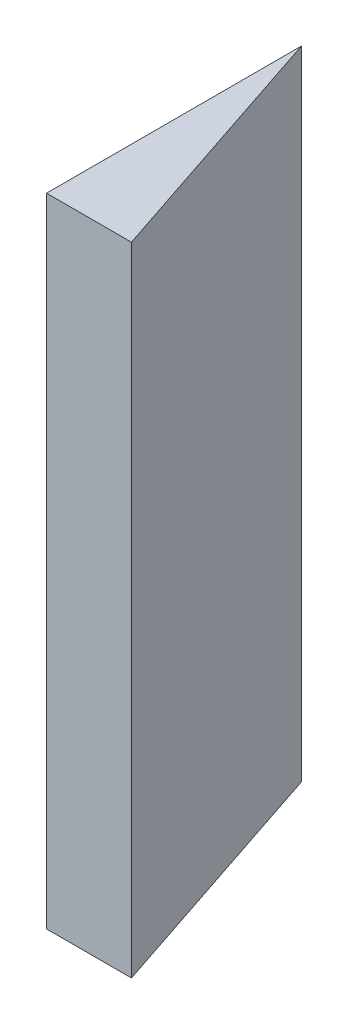
ISO-10303-21;
HEADER;
FILE_DESCRIPTION(('STEP AP214'),'2;1');
FILE_NAME('part.step','',(''),(''),'','','');
FILE_SCHEMA(('AUTOMOTIVE_DESIGN { 1 0 10303 214 1 1 1 1 }'));
ENDSEC;
DATA;
#1=APPLICATION_CONTEXT('core data for automotive mechanical design processes');
#2=APPLICATION_PROTOCOL_DEFINITION('international standard','automotive_design',2000,#1);
#3=PRODUCT_CONTEXT('',#1,'mechanical');
#4=PRODUCT('Part','Part','',(#3));
#5=PRODUCT_RELATED_PRODUCT_CATEGORY('part','',(#4));
#6=PRODUCT_DEFINITION_FORMATION('','',#4);
#7=PRODUCT_DEFINITION_CONTEXT('part definition',#1,'design');
#8=PRODUCT_DEFINITION('design','',#6,#7);
#9=PRODUCT_DEFINITION_SHAPE('','',#8);
#10=(LENGTH_UNIT() NAMED_UNIT(*) SI_UNIT(.MILLI.,.METRE.));
#11=(NAMED_UNIT(*) PLANE_ANGLE_UNIT() SI_UNIT($,.RADIAN.));
#12=(NAMED_UNIT(*) SI_UNIT($,.STERADIAN.) SOLID_ANGLE_UNIT());
#13=UNCERTAINTY_MEASURE_WITH_UNIT(LENGTH_MEASURE(1.E-05),#10,'distance_accuracy_value','');
#14=(GEOMETRIC_REPRESENTATION_CONTEXT(3) GLOBAL_UNCERTAINTY_ASSIGNED_CONTEXT((#13)) GLOBAL_UNIT_ASSIGNED_CONTEXT((#10,
#11,#12)) REPRESENTATION_CONTEXT('',''));
#15=CARTESIAN_POINT('',(0.,0.,0.));
#16=DIRECTION('',(0.,0.,1.));
#17=DIRECTION('',(1.,0.,0.));
#18=AXIS2_PLACEMENT_3D('',#15,#16,#17);
#19=CARTESIAN_POINT('',(-3.9200001311342,-0.749999496443807,-3.67112158656318));
#20=DIRECTION('',(-1.74845553146952E-07,-1.,-8.74227765734759E-08));
#21=DIRECTION('',(1.,-1.74845553146952E-07,0.));
#22=AXIS2_PLACEMENT_3D('',#19,#20,#21);
#23=PLANE('',#22);
#24=DIRECTION('',(0.,8.74227765179643E-08,-0.999999999999996));
#25=VECTOR('',#24,1.);
#26=CARTESIAN_POINT('',(-3.9000001311342,-0.749999536658284,-3.25112158656318));
#27=LINE('',#26,#25);
#28=CARTESIAN_POINT('',(-3.9000001311342,-0.749999536660284,-3.25112158656318));
#29=VERTEX_POINT('',#28);
#30=CARTESIAN_POINT('',(-3.9000001311342,-0.749999501691174,-3.65112158656318));
#31=VERTEX_POINT('',#30);
#32=EDGE_CURVE('E11',#29,#31,#27,.T.);
#33=ORIENTED_EDGE('',*,*,#32,.F.);
#34=DIRECTION('',(-0.999999999999985,1.74845553322981E-07,0.));
#35=VECTOR('',#34,1.);
#36=CARTESIAN_POINT('',(-3.7667779564902,-0.749999559951589,-3.25112158656318));
#37=LINE('',#36,#35);
#38=CARTESIAN_POINT('',(-3.7667779564902,-0.749999559953589,-3.25112158656318));
#39=VERTEX_POINT('',#38);
#40=EDGE_CURVE('E63',#39,#29,#37,.T.);
#41=ORIENTED_EDGE('',*,*,#40,.F.);
#42=DIRECTION('',(0.31599046396719,-1.38192967787591E-07,0.948762365759615));
#43=VECTOR('',#42,1.);
#44=CARTESIAN_POINT('',(-3.9000001311342,-0.749999501689173,-3.65112158656318));
#45=LINE('',#44,#43);
#46=EDGE_CURVE('E70',#31,#39,#45,.T.);
#47=ORIENTED_EDGE('',*,*,#46,.F.);
#48=EDGE_LOOP('',(#33,#41,#47));
#49=FACE_BOUND('',#48,.T.);
#50=ADVANCED_FACE('F17',(#49),#23,.F.);
#51=CARTESIAN_POINT('',(-3.92000030597975,-1.74999949644481,-3.67112167398595));
#52=DIRECTION('',(-1.74845553146952E-07,-1.,-8.74227765734759E-08));
#53=DIRECTION('',(1.,-1.74845553146952E-07,0.));
#54=AXIS2_PLACEMENT_3D('',#51,#52,#53);
#55=PLANE('',#54);
#56=DIRECTION('',(0.315990463967191,-1.38192967524256E-07,0.948762365759614));
#57=VECTOR('',#56,1.);
#58=CARTESIAN_POINT('',(-3.90000030597975,-1.74999950169017,-3.65112167398595));
#59=LINE('',#58,#57);
#60=CARTESIAN_POINT('',(-3.90000030597975,-1.74999950168917,-3.65112167398595));
#61=VERTEX_POINT('',#60);
#62=CARTESIAN_POINT('',(-3.76677813133576,-1.74999955995159,-3.25112167398595));
#63=VERTEX_POINT('',#62);
#64=EDGE_CURVE('E24',#61,#63,#59,.T.);
#65=ORIENTED_EDGE('',*,*,#64,.T.);
#66=DIRECTION('',(-0.999999999999985,1.74845553322982E-07,0.));
#67=VECTOR('',#66,1.);
#68=CARTESIAN_POINT('',(-3.76677813133576,-1.74999955995259,-3.25112167398595));
#69=LINE('',#68,#67);
#70=CARTESIAN_POINT('',(-3.90000030597976,-1.74999953665828,-3.25112167398595));
#71=VERTEX_POINT('',#70);
#72=EDGE_CURVE('E49',#63,#71,#69,.T.);
#73=ORIENTED_EDGE('',*,*,#72,.T.);
#74=DIRECTION('',(0.,8.74227762404085E-08,-0.999999999999996));
#75=VECTOR('',#74,1.);
#76=CARTESIAN_POINT('',(-3.90000030597976,-1.74999953665928,-3.25112167398595));
#77=LINE('',#76,#75);
#78=EDGE_CURVE('E46',#71,#61,#77,.T.);
#79=ORIENTED_EDGE('',*,*,#78,.T.);
#80=EDGE_LOOP('',(#65,#73,#79));
#81=FACE_BOUND('',#80,.T.);
#82=ADVANCED_FACE('F47',(#81),#55,.T.);
#83=CARTESIAN_POINT('',(-3.9000001311342,-0.749999501689174,-3.65112158656318));
#84=DIRECTION('',(0.948762365759624,-1.38262116889164E-07,-0.315990463967207));
#85=DIRECTION('',(0.315990463967192,-1.38192967784634E-07,0.948762365759619));
#86=AXIS2_PLACEMENT_3D('',#83,#84,#85);
#87=PLANE('',#86);
#88=ORIENTED_EDGE('',*,*,#46,.T.);
#89=DIRECTION('',(-1.74845553146774E-07,-0.999999999999981,-8.74227765733868E-08));
#90=VECTOR('',#89,1.);
#91=CARTESIAN_POINT('',(-3.7667779564902,-0.749999559951589,-3.25112158656318));
#92=LINE('',#91,#90);
#93=EDGE_CURVE('E54',#39,#63,#92,.T.);
#94=ORIENTED_EDGE('',*,*,#93,.T.);
#95=ORIENTED_EDGE('',*,*,#64,.F.);
#96=DIRECTION('',(-1.74845553146774E-07,-0.999999999999981,-8.74227765733868E-08));
#97=VECTOR('',#96,1.);
#98=CARTESIAN_POINT('',(-3.9000001311342,-0.749999501689173,-3.65112158656318));
#99=LINE('',#98,#97);
#100=EDGE_CURVE('E61',#31,#61,#99,.T.);
#101=ORIENTED_EDGE('',*,*,#100,.F.);
#102=EDGE_LOOP('',(#88,#94,#95,#101));
#103=FACE_BOUND('',#102,.T.);
#104=ADVANCED_FACE('F60',(#103),#87,.T.);
#105=CARTESIAN_POINT('',(-3.7667779564902,-0.749999559951589,-3.25112158656318));
#106=DIRECTION('',(0.,-8.74227765734759E-08,1.));
#107=DIRECTION('',(-1.,1.74845553146952E-07,0.));
#108=AXIS2_PLACEMENT_3D('',#105,#106,#107);
#109=PLANE('',#108);
#110=ORIENTED_EDGE('',*,*,#40,.T.);
#111=DIRECTION('',(-1.74845553146774E-07,-0.999999999999981,-8.74227765733868E-08));
#112=VECTOR('',#111,1.);
#113=CARTESIAN_POINT('',(-3.9000001311342,-0.749999536658284,-3.25112158656318));
#114=LINE('',#113,#112);
#115=EDGE_CURVE('E55',#29,#71,#114,.T.);
#116=ORIENTED_EDGE('',*,*,#115,.T.);
#117=ORIENTED_EDGE('',*,*,#72,.F.);
#118=ORIENTED_EDGE('',*,*,#93,.F.);
#119=EDGE_LOOP('',(#110,#116,#117,#118));
#120=FACE_BOUND('',#119,.T.);
#121=ADVANCED_FACE('F73',(#120),#109,.T.);
#122=CARTESIAN_POINT('',(-3.9000001311342,-0.749999536658284,-3.25112158656318));
#123=DIRECTION('',(-1.,1.74845553146952E-07,0.));
#124=DIRECTION('',(0.,8.74227765734759E-08,-1.));
#125=AXIS2_PLACEMENT_3D('',#122,#123,#124);
#126=PLANE('',#125);
#127=ORIENTED_EDGE('',*,*,#32,.T.);
#128=ORIENTED_EDGE('',*,*,#100,.T.);
#129=ORIENTED_EDGE('',*,*,#78,.F.);
#130=ORIENTED_EDGE('',*,*,#115,.F.);
#131=EDGE_LOOP('',(#127,#128,#129,#130));
#132=FACE_BOUND('',#131,.T.);
#133=ADVANCED_FACE('F64',(#132),#126,.T.);
#134=CLOSED_SHELL('',(#50,#82,#104,#121,#133));
#135=MANIFOLD_SOLID_BREP('B1',#134);
#136=ADVANCED_BREP_SHAPE_REPRESENTATION('',(#18,#135),#14);
#137=SHAPE_DEFINITION_REPRESENTATION(#9,#136);
ENDSEC;
END-ISO-10303-21;
